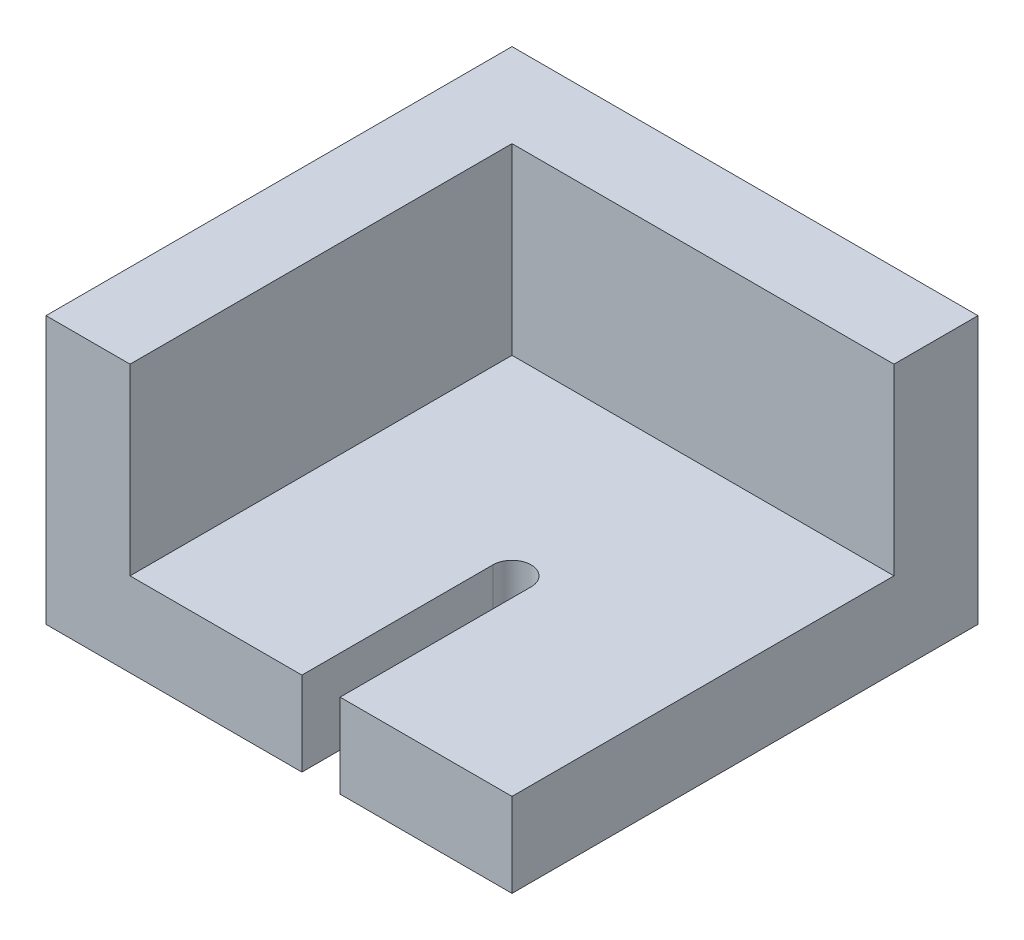
ISO-10303-21;
HEADER;
FILE_DESCRIPTION(('STEP AP214'),'2;1');
FILE_NAME('part.step','',(''),(''),'','','');
FILE_SCHEMA(('AUTOMOTIVE_DESIGN { 1 0 10303 214 1 1 1 1 }'));
ENDSEC;
DATA;
#1=APPLICATION_CONTEXT('core data for automotive mechanical design processes');
#2=APPLICATION_PROTOCOL_DEFINITION('international standard','automotive_design',2000,#1);
#3=PRODUCT_CONTEXT('',#1,'mechanical');
#4=PRODUCT('Part','Part','',(#3));
#5=PRODUCT_RELATED_PRODUCT_CATEGORY('part','',(#4));
#6=PRODUCT_DEFINITION_FORMATION('','',#4);
#7=PRODUCT_DEFINITION_CONTEXT('part definition',#1,'design');
#8=PRODUCT_DEFINITION('design','',#6,#7);
#9=PRODUCT_DEFINITION_SHAPE('','',#8);
#10=(LENGTH_UNIT() NAMED_UNIT(*) SI_UNIT(.MILLI.,.METRE.));
#11=(NAMED_UNIT(*) PLANE_ANGLE_UNIT() SI_UNIT($,.RADIAN.));
#12=(NAMED_UNIT(*) SI_UNIT($,.STERADIAN.) SOLID_ANGLE_UNIT());
#13=UNCERTAINTY_MEASURE_WITH_UNIT(LENGTH_MEASURE(1.E-05),#10,'distance_accuracy_value','');
#14=(GEOMETRIC_REPRESENTATION_CONTEXT(3) GLOBAL_UNCERTAINTY_ASSIGNED_CONTEXT((#13)) GLOBAL_UNIT_ASSIGNED_CONTEXT((#10,
#11,#12)) REPRESENTATION_CONTEXT('',''));
#15=CARTESIAN_POINT('',(0.,0.,0.));
#16=DIRECTION('',(0.,0.,1.));
#17=DIRECTION('',(1.,0.,0.));
#18=AXIS2_PLACEMENT_3D('',#15,#16,#17);
#19=CARTESIAN_POINT('',(-0.0100000000000033,70.,-0.0100000000000033));
#20=DIRECTION('',(0.,1.,0.));
#21=DIRECTION('',(0.,0.,1.));
#22=AXIS2_PLACEMENT_3D('',#19,#20,#21);
#23=PLANE('',#22);
#24=DIRECTION('',(0.,0.,-1.));
#25=VECTOR('',#24,1.);
#26=CARTESIAN_POINT('',(0.,70.,61.));
#27=LINE('',#26,#25);
#28=CARTESIAN_POINT('',(0.,70.,122.));
#29=VERTEX_POINT('',#28);
#30=CARTESIAN_POINT('',(0.,70.,0.));
#31=VERTEX_POINT('',#30);
#32=EDGE_CURVE('E96',#29,#31,#27,.T.);
#33=ORIENTED_EDGE('',*,*,#32,.F.);
#34=DIRECTION('',(-1.,0.,0.));
#35=VECTOR('',#34,1.);
#36=CARTESIAN_POINT('',(33.5,70.,122.));
#37=LINE('',#36,#35);
#38=CARTESIAN_POINT('',(22.,70.,122.));
#39=VERTEX_POINT('',#38);
#40=EDGE_CURVE('E139',#39,#29,#37,.T.);
#41=ORIENTED_EDGE('',*,*,#40,.F.);
#42=DIRECTION('',(0.,0.,1.));
#43=VECTOR('',#42,1.);
#44=CARTESIAN_POINT('',(22.,70.,72.));
#45=LINE('',#44,#43);
#46=CARTESIAN_POINT('',(22.,70.,22.));
#47=VERTEX_POINT('',#46);
#48=EDGE_CURVE('E148',#47,#39,#45,.T.);
#49=ORIENTED_EDGE('',*,*,#48,.F.);
#50=DIRECTION('',(-1.,0.,0.));
#51=VECTOR('',#50,1.);
#52=CARTESIAN_POINT('',(72.,70.,22.));
#53=LINE('',#52,#51);
#54=CARTESIAN_POINT('',(122.,70.,22.));
#55=VERTEX_POINT('',#54);
#56=EDGE_CURVE('E164',#55,#47,#53,.T.);
#57=ORIENTED_EDGE('',*,*,#56,.F.);
#58=DIRECTION('',(0.,0.,1.));
#59=VECTOR('',#58,1.);
#60=CARTESIAN_POINT('',(122.,70.,61.));
#61=LINE('',#60,#59);
#62=CARTESIAN_POINT('',(122.,70.,0.));
#63=VERTEX_POINT('',#62);
#64=EDGE_CURVE('E112',#63,#55,#61,.T.);
#65=ORIENTED_EDGE('',*,*,#64,.F.);
#66=DIRECTION('',(1.,0.,0.));
#67=VECTOR('',#66,1.);
#68=CARTESIAN_POINT('',(61.,70.,0.));
#69=LINE('',#68,#67);
#70=EDGE_CURVE('E110',#31,#63,#69,.T.);
#71=ORIENTED_EDGE('',*,*,#70,.F.);
#72=EDGE_LOOP('',(#33,#41,#49,#57,#65,#71));
#73=FACE_BOUND('',#72,.T.);
#74=ADVANCED_FACE('F17',(#73),#23,.T.);
#75=CARTESIAN_POINT('',(0.,-0.01,-0.01));
#76=DIRECTION('',(-1.,0.,0.));
#77=DIRECTION('',(0.,0.,1.));
#78=AXIS2_PLACEMENT_3D('',#75,#76,#77);
#79=PLANE('',#78);
#80=ORIENTED_EDGE('',*,*,#32,.T.);
#81=DIRECTION('',(0.,1.,0.));
#82=VECTOR('',#81,1.);
#83=CARTESIAN_POINT('',(0.,35.,0.));
#84=LINE('',#83,#82);
#85=CARTESIAN_POINT('',(0.,0.,0.));
#86=VERTEX_POINT('',#85);
#87=EDGE_CURVE('E101',#86,#31,#84,.T.);
#88=ORIENTED_EDGE('',*,*,#87,.F.);
#89=DIRECTION('',(0.,0.,-1.));
#90=VECTOR('',#89,1.);
#91=CARTESIAN_POINT('',(0.,0.,61.));
#92=LINE('',#91,#90);
#93=CARTESIAN_POINT('',(0.,0.,122.));
#94=VERTEX_POINT('',#93);
#95=EDGE_CURVE('E128',#94,#86,#92,.T.);
#96=ORIENTED_EDGE('',*,*,#95,.F.);
#97=DIRECTION('',(0.,-1.,0.));
#98=VECTOR('',#97,1.);
#99=CARTESIAN_POINT('',(0.,35.,122.));
#100=LINE('',#99,#98);
#101=EDGE_CURVE('E104',#29,#94,#100,.T.);
#102=ORIENTED_EDGE('',*,*,#101,.F.);
#103=EDGE_LOOP('',(#80,#88,#96,#102));
#104=FACE_BOUND('',#103,.T.);
#105=ADVANCED_FACE('F98',(#104),#79,.T.);
#106=CARTESIAN_POINT('',(122.01,-0.01,0.));
#107=DIRECTION('',(0.,0.,-1.));
#108=DIRECTION('',(-1.,0.,0.));
#109=AXIS2_PLACEMENT_3D('',#106,#107,#108);
#110=PLANE('',#109);
#111=ORIENTED_EDGE('',*,*,#70,.T.);
#112=DIRECTION('',(0.,1.,0.));
#113=VECTOR('',#112,1.);
#114=CARTESIAN_POINT('',(122.,35.,0.));
#115=LINE('',#114,#113);
#116=CARTESIAN_POINT('',(122.,0.,0.));
#117=VERTEX_POINT('',#116);
#118=EDGE_CURVE('E115',#117,#63,#115,.T.);
#119=ORIENTED_EDGE('',*,*,#118,.F.);
#120=DIRECTION('',(1.,0.,0.));
#121=VECTOR('',#120,1.);
#122=CARTESIAN_POINT('',(61.,0.,0.));
#123=LINE('',#122,#121);
#124=EDGE_CURVE('E119',#86,#117,#123,.T.);
#125=ORIENTED_EDGE('',*,*,#124,.F.);
#126=ORIENTED_EDGE('',*,*,#87,.T.);
#127=EDGE_LOOP('',(#111,#119,#125,#126));
#128=FACE_BOUND('',#127,.T.);
#129=ADVANCED_FACE('F117',(#128),#110,.T.);
#130=CARTESIAN_POINT('',(122.,-0.01,122.01));
#131=DIRECTION('',(1.,0.,0.));
#132=DIRECTION('',(0.,0.,-1.));
#133=AXIS2_PLACEMENT_3D('',#130,#131,#132);
#134=PLANE('',#133);
#135=DIRECTION('',(0.,0.,-1.));
#136=VECTOR('',#135,1.);
#137=CARTESIAN_POINT('',(122.,22.,72.));
#138=LINE('',#137,#136);
#139=CARTESIAN_POINT('',(122.,22.,122.));
#140=VERTEX_POINT('',#139);
#141=CARTESIAN_POINT('',(122.,22.,22.));
#142=VERTEX_POINT('',#141);
#143=EDGE_CURVE('E173',#140,#142,#138,.T.);
#144=ORIENTED_EDGE('',*,*,#143,.F.);
#145=DIRECTION('',(0.,1.,0.));
#146=VECTOR('',#145,1.);
#147=CARTESIAN_POINT('',(122.,11.,122.));
#148=LINE('',#147,#146);
#149=CARTESIAN_POINT('',(122.,0.,122.));
#150=VERTEX_POINT('',#149);
#151=EDGE_CURVE('E225',#150,#140,#148,.T.);
#152=ORIENTED_EDGE('',*,*,#151,.F.);
#153=DIRECTION('',(0.,0.,1.));
#154=VECTOR('',#153,1.);
#155=CARTESIAN_POINT('',(122.,0.,61.));
#156=LINE('',#155,#154);
#157=EDGE_CURVE('E199',#117,#150,#156,.T.);
#158=ORIENTED_EDGE('',*,*,#157,.F.);
#159=ORIENTED_EDGE('',*,*,#118,.T.);
#160=ORIENTED_EDGE('',*,*,#64,.T.);
#161=DIRECTION('',(0.,1.,0.));
#162=VECTOR('',#161,1.);
#163=CARTESIAN_POINT('',(122.,46.,22.));
#164=LINE('',#163,#162);
#165=EDGE_CURVE('E168',#142,#55,#164,.T.);
#166=ORIENTED_EDGE('',*,*,#165,.F.);
#167=EDGE_LOOP('',(#144,#152,#158,#159,#160,#166));
#168=FACE_BOUND('',#167,.T.);
#169=ADVANCED_FACE('F342',(#168),#134,.T.);
#170=CARTESIAN_POINT('',(21.99,21.99,22.));
#171=DIRECTION('',(0.,0.,1.));
#172=DIRECTION('',(1.,0.,0.));
#173=AXIS2_PLACEMENT_3D('',#170,#171,#172);
#174=PLANE('',#173);
#175=ORIENTED_EDGE('',*,*,#56,.T.);
#176=DIRECTION('',(0.,1.,0.));
#177=VECTOR('',#176,1.);
#178=CARTESIAN_POINT('',(22.,46.,22.));
#179=LINE('',#178,#177);
#180=CARTESIAN_POINT('',(22.,22.,22.));
#181=VERTEX_POINT('',#180);
#182=EDGE_CURVE('E152',#181,#47,#179,.T.);
#183=ORIENTED_EDGE('',*,*,#182,.F.);
#184=DIRECTION('',(-1.,0.,0.));
#185=VECTOR('',#184,1.);
#186=CARTESIAN_POINT('',(72.,22.,22.));
#187=LINE('',#186,#185);
#188=EDGE_CURVE('E159',#142,#181,#187,.T.);
#189=ORIENTED_EDGE('',*,*,#188,.F.);
#190=ORIENTED_EDGE('',*,*,#165,.T.);
#191=EDGE_LOOP('',(#175,#183,#189,#190));
#192=FACE_BOUND('',#191,.T.);
#193=ADVANCED_FACE('F333',(#192),#174,.T.);
#194=CARTESIAN_POINT('',(22.,21.99,122.01));
#195=DIRECTION('',(1.,0.,0.));
#196=DIRECTION('',(0.,0.,-1.));
#197=AXIS2_PLACEMENT_3D('',#194,#195,#196);
#198=PLANE('',#197);
#199=ORIENTED_EDGE('',*,*,#48,.T.);
#200=DIRECTION('',(0.,1.,0.));
#201=VECTOR('',#200,1.);
#202=CARTESIAN_POINT('',(22.,35.,122.));
#203=LINE('',#202,#201);
#204=CARTESIAN_POINT('',(22.,22.,122.));
#205=VERTEX_POINT('',#204);
#206=EDGE_CURVE('E62',#205,#39,#203,.T.);
#207=ORIENTED_EDGE('',*,*,#206,.F.);
#208=DIRECTION('',(0.,0.,1.));
#209=VECTOR('',#208,1.);
#210=CARTESIAN_POINT('',(22.,22.,72.));
#211=LINE('',#210,#209);
#212=EDGE_CURVE('E155',#181,#205,#211,.T.);
#213=ORIENTED_EDGE('',*,*,#212,.F.);
#214=ORIENTED_EDGE('',*,*,#182,.T.);
#215=EDGE_LOOP('',(#199,#207,#213,#214));
#216=FACE_BOUND('',#215,.T.);
#217=ADVANCED_FACE('F324',(#216),#198,.T.);
#218=CARTESIAN_POINT('',(-0.01,-0.01,122.));
#219=DIRECTION('',(0.,0.,1.));
#220=DIRECTION('',(1.,0.,0.));
#221=AXIS2_PLACEMENT_3D('',#218,#219,#220);
#222=PLANE('',#221);
#223=ORIENTED_EDGE('',*,*,#101,.T.);
#224=DIRECTION('',(-1.,0.,0.));
#225=VECTOR('',#224,1.);
#226=CARTESIAN_POINT('',(61.,0.,122.));
#227=LINE('',#226,#225);
#228=CARTESIAN_POINT('',(67.,0.,122.));
#229=VERTEX_POINT('',#228);
#230=EDGE_CURVE('E130',#229,#94,#227,.T.);
#231=ORIENTED_EDGE('',*,*,#230,.F.);
#232=DIRECTION('',(0.,-1.,0.));
#233=VECTOR('',#232,1.);
#234=CARTESIAN_POINT('',(67.,11.,122.));
#235=LINE('',#234,#233);
#236=CARTESIAN_POINT('',(67.,22.,122.));
#237=VERTEX_POINT('',#236);
#238=EDGE_CURVE('E138',#237,#229,#235,.T.);
#239=ORIENTED_EDGE('',*,*,#238,.F.);
#240=DIRECTION('',(1.,0.,0.));
#241=VECTOR('',#240,1.);
#242=CARTESIAN_POINT('',(72.,22.,122.));
#243=LINE('',#242,#241);
#244=EDGE_CURVE('E158',#205,#237,#243,.T.);
#245=ORIENTED_EDGE('',*,*,#244,.F.);
#246=ORIENTED_EDGE('',*,*,#206,.T.);
#247=ORIENTED_EDGE('',*,*,#40,.T.);
#248=EDGE_LOOP('',(#223,#231,#239,#245,#246,#247));
#249=FACE_BOUND('',#248,.T.);
#250=ADVANCED_FACE('F315',(#249),#222,.T.);
#251=CARTESIAN_POINT('',(67.,22.01,71.99));
#252=DIRECTION('',(1.,0.,0.));
#253=DIRECTION('',(0.,0.,1.));
#254=AXIS2_PLACEMENT_3D('',#251,#252,#253);
#255=PLANE('',#254);
#256=DIRECTION('',(0.,0.,-1.));
#257=VECTOR('',#256,1.);
#258=CARTESIAN_POINT('',(67.,22.,72.));
#259=LINE('',#258,#257);
#260=CARTESIAN_POINT('',(67.,22.,72.));
#261=VERTEX_POINT('',#260);
#262=EDGE_CURVE('E244',#237,#261,#259,.T.);
#263=ORIENTED_EDGE('',*,*,#262,.F.);
#264=ORIENTED_EDGE('',*,*,#238,.T.);
#265=DIRECTION('',(0.,0.,1.));
#266=VECTOR('',#265,1.);
#267=CARTESIAN_POINT('',(67.,0.,61.));
#268=LINE('',#267,#266);
#269=CARTESIAN_POINT('',(67.,0.,72.));
#270=VERTEX_POINT('',#269);
#271=EDGE_CURVE('E53',#270,#229,#268,.T.);
#272=ORIENTED_EDGE('',*,*,#271,.F.);
#273=DIRECTION('',(0.,-1.,0.));
#274=VECTOR('',#273,1.);
#275=CARTESIAN_POINT('',(67.,11.,72.));
#276=LINE('',#275,#274);
#277=EDGE_CURVE('E184',#261,#270,#276,.T.);
#278=ORIENTED_EDGE('',*,*,#277,.F.);
#279=EDGE_LOOP('',(#263,#264,#272,#278));
#280=FACE_BOUND('',#279,.T.);
#281=ADVANCED_FACE('F306',(#280),#255,.T.);
#282=CARTESIAN_POINT('',(122.01,0.,122.01));
#283=DIRECTION('',(0.,-1.,0.));
#284=DIRECTION('',(-1.,0.,0.));
#285=AXIS2_PLACEMENT_3D('',#282,#283,#284);
#286=PLANE('',#285);
#287=DIRECTION('',(0.,0.,1.));
#288=VECTOR('',#287,1.);
#289=CARTESIAN_POINT('',(77.,0.,97.));
#290=LINE('',#289,#288);
#291=CARTESIAN_POINT('',(77.,0.,72.));
#292=VERTEX_POINT('',#291);
#293=CARTESIAN_POINT('',(77.,0.,122.));
#294=VERTEX_POINT('',#293);
#295=EDGE_CURVE('E187',#292,#294,#290,.T.);
#296=ORIENTED_EDGE('',*,*,#295,.F.);
#297=CARTESIAN_POINT('',(72.,0.,72.));
#298=DIRECTION('',(0.,-1.,0.));
#299=DIRECTION('',(0.,0.,-1.));
#300=AXIS2_PLACEMENT_3D('',#297,#298,#299);
#301=CIRCLE('',#300,5.);
#302=EDGE_CURVE('E21',#270,#292,#301,.T.);
#303=ORIENTED_EDGE('',*,*,#302,.F.);
#304=ORIENTED_EDGE('',*,*,#271,.T.);
#305=ORIENTED_EDGE('',*,*,#230,.T.);
#306=ORIENTED_EDGE('',*,*,#95,.T.);
#307=ORIENTED_EDGE('',*,*,#124,.T.);
#308=ORIENTED_EDGE('',*,*,#157,.T.);
#309=DIRECTION('',(1.,0.,0.));
#310=VECTOR('',#309,1.);
#311=CARTESIAN_POINT('',(99.5,0.,122.));
#312=LINE('',#311,#310);
#313=EDGE_CURVE('E202',#294,#150,#312,.T.);
#314=ORIENTED_EDGE('',*,*,#313,.F.);
#315=EDGE_LOOP('',(#296,#303,#304,#305,#306,#307,#308,#314));
#316=FACE_BOUND('',#315,.T.);
#317=ADVANCED_FACE('F209',(#316),#286,.T.);
#318=CARTESIAN_POINT('',(76.99,-0.01,122.));
#319=DIRECTION('',(0.,0.,1.));
#320=DIRECTION('',(1.,0.,0.));
#321=AXIS2_PLACEMENT_3D('',#318,#319,#320);
#322=PLANE('',#321);
#323=ORIENTED_EDGE('',*,*,#151,.T.);
#324=DIRECTION('',(1.,0.,0.));
#325=VECTOR('',#324,1.);
#326=CARTESIAN_POINT('',(72.,22.,122.));
#327=LINE('',#326,#325);
#328=CARTESIAN_POINT('',(77.,22.,122.));
#329=VERTEX_POINT('',#328);
#330=EDGE_CURVE('E249',#329,#140,#327,.T.);
#331=ORIENTED_EDGE('',*,*,#330,.F.);
#332=DIRECTION('',(0.,1.,0.));
#333=VECTOR('',#332,1.);
#334=CARTESIAN_POINT('',(77.,11.,122.));
#335=LINE('',#334,#333);
#336=EDGE_CURVE('E231',#294,#329,#335,.T.);
#337=ORIENTED_EDGE('',*,*,#336,.F.);
#338=ORIENTED_EDGE('',*,*,#313,.T.);
#339=EDGE_LOOP('',(#323,#331,#337,#338));
#340=FACE_BOUND('',#339,.T.);
#341=ADVANCED_FACE('F261',(#340),#322,.T.);
#342=CARTESIAN_POINT('',(21.99,22.,21.99));
#343=DIRECTION('',(0.,1.,0.));
#344=DIRECTION('',(0.,0.,1.));
#345=AXIS2_PLACEMENT_3D('',#342,#343,#344);
#346=PLANE('',#345);
#347=ORIENTED_EDGE('',*,*,#212,.T.);
#348=ORIENTED_EDGE('',*,*,#244,.T.);
#349=ORIENTED_EDGE('',*,*,#262,.T.);
#350=CARTESIAN_POINT('',(72.,22.,72.));
#351=DIRECTION('',(0.,-1.,0.));
#352=DIRECTION('',(0.,0.,-1.));
#353=AXIS2_PLACEMENT_3D('',#350,#351,#352);
#354=CIRCLE('',#353,5.);
#355=CARTESIAN_POINT('',(77.,22.,72.));
#356=VERTEX_POINT('',#355);
#357=EDGE_CURVE('E36',#356,#261,#354,.F.);
#358=ORIENTED_EDGE('',*,*,#357,.F.);
#359=DIRECTION('',(0.,0.,-1.));
#360=VECTOR('',#359,1.);
#361=CARTESIAN_POINT('',(77.,22.,97.));
#362=LINE('',#361,#360);
#363=EDGE_CURVE('E27',#329,#356,#362,.T.);
#364=ORIENTED_EDGE('',*,*,#363,.F.);
#365=ORIENTED_EDGE('',*,*,#330,.T.);
#366=ORIENTED_EDGE('',*,*,#143,.T.);
#367=ORIENTED_EDGE('',*,*,#188,.T.);
#368=EDGE_LOOP('',(#347,#348,#349,#358,#364,#365,#366,#367));
#369=FACE_BOUND('',#368,.T.);
#370=ADVANCED_FACE('F265',(#369),#346,.T.);
#371=CARTESIAN_POINT('',(72.,22.,72.));
#372=DIRECTION('',(0.,-1.,0.));
#373=DIRECTION('',(0.,0.,-1.));
#374=AXIS2_PLACEMENT_3D('',#371,#372,#373);
#375=CYLINDRICAL_SURFACE('',#374,5.);
#376=ORIENTED_EDGE('',*,*,#357,.T.);
#377=ORIENTED_EDGE('',*,*,#277,.T.);
#378=ORIENTED_EDGE('',*,*,#302,.T.);
#379=DIRECTION('',(0.,-1.,0.));
#380=VECTOR('',#379,1.);
#381=CARTESIAN_POINT('',(77.,11.,72.));
#382=LINE('',#381,#380);
#383=EDGE_CURVE('E11',#356,#292,#382,.T.);
#384=ORIENTED_EDGE('',*,*,#383,.F.);
#385=EDGE_LOOP('',(#376,#377,#378,#384));
#386=FACE_BOUND('',#385,.T.);
#387=ADVANCED_FACE('F267',(#386),#375,.F.);
#388=CARTESIAN_POINT('',(77.,22.01,122.01));
#389=DIRECTION('',(-1.,0.,0.));
#390=DIRECTION('',(0.,0.,-1.));
#391=AXIS2_PLACEMENT_3D('',#388,#389,#390);
#392=PLANE('',#391);
#393=ORIENTED_EDGE('',*,*,#363,.T.);
#394=ORIENTED_EDGE('',*,*,#383,.T.);
#395=ORIENTED_EDGE('',*,*,#295,.T.);
#396=ORIENTED_EDGE('',*,*,#336,.T.);
#397=EDGE_LOOP('',(#393,#394,#395,#396));
#398=FACE_BOUND('',#397,.T.);
#399=ADVANCED_FACE('F19',(#398),#392,.T.);
#400=CLOSED_SHELL('',(#74,#105,#129,#169,#193,#217,#250,#281,#317,#341,#370,#387,#399));
#401=MANIFOLD_SOLID_BREP('B1',#400);
#402=ADVANCED_BREP_SHAPE_REPRESENTATION('',(#18,#401),#14);
#403=SHAPE_DEFINITION_REPRESENTATION(#9,#402);
ENDSEC;
END-ISO-10303-21;
